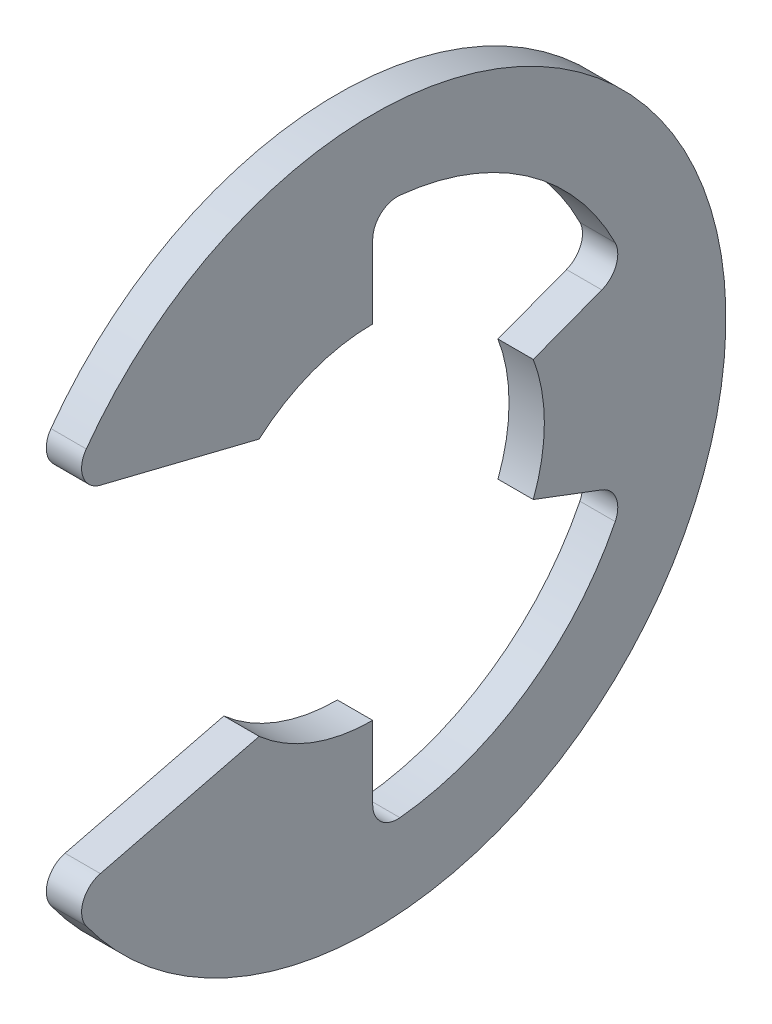
ISO-10303-21;
HEADER;
FILE_DESCRIPTION(('STEP AP214'),'2;1');
FILE_NAME('part.step','',(''),(''),'','','');
FILE_SCHEMA(('AUTOMOTIVE_DESIGN { 1 0 10303 214 1 1 1 1 }'));
ENDSEC;
DATA;
#1=APPLICATION_CONTEXT('core data for automotive mechanical design processes');
#2=APPLICATION_PROTOCOL_DEFINITION('international standard','automotive_design',2000,#1);
#3=PRODUCT_CONTEXT('',#1,'mechanical');
#4=PRODUCT('Part','Part','',(#3));
#5=PRODUCT_RELATED_PRODUCT_CATEGORY('part','',(#4));
#6=PRODUCT_DEFINITION_FORMATION('','',#4);
#7=PRODUCT_DEFINITION_CONTEXT('part definition',#1,'design');
#8=PRODUCT_DEFINITION('design','',#6,#7);
#9=PRODUCT_DEFINITION_SHAPE('','',#8);
#10=(LENGTH_UNIT() NAMED_UNIT(*) SI_UNIT(.MILLI.,.METRE.));
#11=(NAMED_UNIT(*) PLANE_ANGLE_UNIT() SI_UNIT($,.RADIAN.));
#12=(NAMED_UNIT(*) SI_UNIT($,.STERADIAN.) SOLID_ANGLE_UNIT());
#13=UNCERTAINTY_MEASURE_WITH_UNIT(LENGTH_MEASURE(1.E-05),#10,'distance_accuracy_value','');
#14=(GEOMETRIC_REPRESENTATION_CONTEXT(3) GLOBAL_UNCERTAINTY_ASSIGNED_CONTEXT((#13)) GLOBAL_UNIT_ASSIGNED_CONTEXT((#10,
#11,#12)) REPRESENTATION_CONTEXT('',''));
#15=CARTESIAN_POINT('',(0.,0.,0.));
#16=DIRECTION('',(0.,0.,1.));
#17=DIRECTION('',(1.,0.,0.));
#18=AXIS2_PLACEMENT_3D('',#15,#16,#17);
#19=CARTESIAN_POINT('',(0.3175,0.,0.));
#20=DIRECTION('',(-1.,0.,0.));
#21=DIRECTION('',(0.,0.,1.));
#22=AXIS2_PLACEMENT_3D('',#19,#20,#21);
#23=CYLINDRICAL_SURFACE('',#22,6.35);
#24=CARTESIAN_POINT('',(0.3175,0.,0.));
#25=DIRECTION('',(1.,0.,0.));
#26=DIRECTION('',(0.,0.,-1.));
#27=AXIS2_PLACEMENT_3D('',#24,#25,#26);
#28=CIRCLE('',#27,6.35);
#29=CARTESIAN_POINT('',(0.3175,-3.7148992719595,5.14995372786929));
#30=VERTEX_POINT('',#29);
#31=CARTESIAN_POINT('',(0.3175,3.7148992719595,5.14995372786929));
#32=VERTEX_POINT('',#31);
#33=EDGE_CURVE('E170',#30,#32,#28,.T.);
#34=ORIENTED_EDGE('',*,*,#33,.F.);
#35=DIRECTION('',(-1.,0.,0.));
#36=VECTOR('',#35,1.);
#37=CARTESIAN_POINT('',(0.3175,-3.7148992719595,5.14995372786929));
#38=LINE('',#37,#36);
#39=CARTESIAN_POINT('',(-0.3175,-3.7148992719595,5.14995372786929));
#40=VERTEX_POINT('',#39);
#41=EDGE_CURVE('E264',#30,#40,#38,.T.);
#42=ORIENTED_EDGE('',*,*,#41,.T.);
#43=CARTESIAN_POINT('',(-0.3175,0.,0.));
#44=DIRECTION('',(1.,0.,0.));
#45=DIRECTION('',(0.,0.,-1.));
#46=AXIS2_PLACEMENT_3D('',#43,#44,#45);
#47=CIRCLE('',#46,6.35);
#48=CARTESIAN_POINT('',(-0.3175,3.7148992719595,5.14995372786929));
#49=VERTEX_POINT('',#48);
#50=EDGE_CURVE('E208',#40,#49,#47,.T.);
#51=ORIENTED_EDGE('',*,*,#50,.T.);
#52=DIRECTION('',(-1.,0.,0.));
#53=VECTOR('',#52,1.);
#54=CARTESIAN_POINT('',(0.3175,3.7148992719595,5.14995372786929));
#55=LINE('',#54,#53);
#56=EDGE_CURVE('E262',#49,#32,#55,.F.);
#57=ORIENTED_EDGE('',*,*,#56,.T.);
#58=EDGE_LOOP('',(#34,#42,#51,#57));
#59=FACE_BOUND('',#58,.T.);
#60=ADVANCED_FACE('F32',(#59),#23,.T.);
#61=CARTESIAN_POINT('',(0.3175,3.17332392884382,5.5002286536677));
#62=DIRECTION('',(0.,0.970536829925373,-0.240952820606873));
#63=DIRECTION('',(0.,0.240952820606873,0.970536829925373));
#64=AXIS2_PLACEMENT_3D('',#61,#62,#63);
#65=PLANE('',#64);
#66=DIRECTION('',(0.,-0.240952820606873,-0.970536829925373));
#67=VECTOR('',#66,1.);
#68=CARTESIAN_POINT('',(0.3175,3.17332392884382,5.5002286536677));
#69=LINE('',#68,#67);
#70=CARTESIAN_POINT('',(0.3175,3.02345270202051,4.89656049567819));
#71=VERTEX_POINT('',#70);
#72=CARTESIAN_POINT('',(0.3175,2.314575,2.04126328026911));
#73=VERTEX_POINT('',#72);
#74=EDGE_CURVE('E156',#71,#73,#69,.T.);
#75=ORIENTED_EDGE('',*,*,#74,.F.);
#76=DIRECTION('',(-1.,0.,0.));
#77=VECTOR('',#76,1.);
#78=CARTESIAN_POINT('',(0.3175,3.02345270202051,4.89656049567819));
#79=LINE('',#78,#77);
#80=CARTESIAN_POINT('',(-0.3175,3.02345270202051,4.89656049567819));
#81=VERTEX_POINT('',#80);
#82=EDGE_CURVE('E276',#71,#81,#79,.T.);
#83=ORIENTED_EDGE('',*,*,#82,.T.);
#84=DIRECTION('',(0.,-0.240952820606873,-0.970536829925373));
#85=VECTOR('',#84,1.);
#86=CARTESIAN_POINT('',(-0.3175,3.17332392884382,5.5002286536677));
#87=LINE('',#86,#85);
#88=CARTESIAN_POINT('',(-0.3175,2.314575,2.04126328026911));
#89=VERTEX_POINT('',#88);
#90=EDGE_CURVE('E176',#81,#89,#87,.T.);
#91=ORIENTED_EDGE('',*,*,#90,.T.);
#92=DIRECTION('',(-1.,0.,0.));
#93=VECTOR('',#92,1.);
#94=CARTESIAN_POINT('',(0.3175,2.314575,2.04126328026911));
#95=LINE('',#94,#93);
#96=EDGE_CURVE('E173',#73,#89,#95,.T.);
#97=ORIENTED_EDGE('',*,*,#96,.F.);
#98=EDGE_LOOP('',(#75,#83,#91,#97));
#99=FACE_BOUND('',#98,.T.);
#100=ADVANCED_FACE('F174',(#99),#65,.F.);
#101=CARTESIAN_POINT('',(0.3175,0.,0.));
#102=DIRECTION('',(-1.,0.,0.));
#103=DIRECTION('',(0.,0.,1.));
#104=AXIS2_PLACEMENT_3D('',#101,#102,#103);
#105=CYLINDRICAL_SURFACE('',#104,3.0861);
#106=CARTESIAN_POINT('',(-0.3175,0.,0.));
#107=DIRECTION('',(-1.,0.,0.));
#108=DIRECTION('',(0.,0.,1.));
#109=AXIS2_PLACEMENT_3D('',#106,#107,#108);
#110=CIRCLE('',#109,3.0861);
#111=CARTESIAN_POINT('',(-0.3175,3.0861,0.));
#112=VERTEX_POINT('',#111);
#113=EDGE_CURVE('E212',#89,#112,#110,.T.);
#114=ORIENTED_EDGE('',*,*,#113,.T.);
#115=DIRECTION('',(-1.,0.,0.));
#116=VECTOR('',#115,1.);
#117=CARTESIAN_POINT('',(0.3175,3.0861,0.));
#118=LINE('',#117,#116);
#119=CARTESIAN_POINT('',(0.3175,3.0861,0.));
#120=VERTEX_POINT('',#119);
#121=EDGE_CURVE('E180',#120,#112,#118,.T.);
#122=ORIENTED_EDGE('',*,*,#121,.F.);
#123=CARTESIAN_POINT('',(0.3175,0.,0.));
#124=DIRECTION('',(-1.,0.,0.));
#125=DIRECTION('',(0.,0.,1.));
#126=AXIS2_PLACEMENT_3D('',#123,#124,#125);
#127=CIRCLE('',#126,3.0861);
#128=EDGE_CURVE('E162',#73,#120,#127,.T.);
#129=ORIENTED_EDGE('',*,*,#128,.F.);
#130=ORIENTED_EDGE('',*,*,#96,.T.);
#131=EDGE_LOOP('',(#114,#122,#129,#130));
#132=FACE_BOUND('',#131,.T.);
#133=ADVANCED_FACE('F182',(#132),#105,.F.);
#134=CARTESIAN_POINT('',(0.3175,3.0861,0.));
#135=DIRECTION('',(0.,0.,1.));
#136=DIRECTION('',(0.,-1.,0.));
#137=AXIS2_PLACEMENT_3D('',#134,#135,#136);
#138=PLANE('',#137);
#139=DIRECTION('',(0.,1.,0.));
#140=VECTOR('',#139,1.);
#141=CARTESIAN_POINT('',(-0.3175,3.0861,0.));
#142=LINE('',#141,#140);
#143=CARTESIAN_POINT('',(-0.3175,4.40336689167331,0.));
#144=VERTEX_POINT('',#143);
#145=EDGE_CURVE('E214',#112,#144,#142,.T.);
#146=ORIENTED_EDGE('',*,*,#145,.T.);
#147=DIRECTION('',(1.,0.,0.));
#148=VECTOR('',#147,1.);
#149=CARTESIAN_POINT('',(0.3175,4.40336689167331,0.));
#150=LINE('',#149,#148);
#151=CARTESIAN_POINT('',(0.3175,4.40336689167331,0.));
#152=VERTEX_POINT('',#151);
#153=EDGE_CURVE('E260',#144,#152,#150,.T.);
#154=ORIENTED_EDGE('',*,*,#153,.T.);
#155=DIRECTION('',(0.,1.,0.));
#156=VECTOR('',#155,1.);
#157=CARTESIAN_POINT('',(0.3175,3.0861,0.));
#158=LINE('',#157,#156);
#159=EDGE_CURVE('E185',#120,#152,#158,.T.);
#160=ORIENTED_EDGE('',*,*,#159,.F.);
#161=ORIENTED_EDGE('',*,*,#121,.T.);
#162=EDGE_LOOP('',(#146,#154,#160,#161));
#163=FACE_BOUND('',#162,.T.);
#164=ADVANCED_FACE('F382',(#163),#138,.F.);
#165=CARTESIAN_POINT('',(0.3175,0.,0.));
#166=DIRECTION('',(-1.,0.,0.));
#167=DIRECTION('',(0.,0.,1.));
#168=AXIS2_PLACEMENT_3D('',#165,#166,#167);
#169=CYLINDRICAL_SURFACE('',#168,4.87024516129032);
#170=CARTESIAN_POINT('',(0.3175,0.,0.));
#171=DIRECTION('',(-1.,0.,0.));
#172=DIRECTION('',(0.,0.,-1.));
#173=AXIS2_PLACEMENT_3D('',#170,#171,#172);
#174=CIRCLE('',#173,4.87024516129032);
#175=CARTESIAN_POINT('',(0.3175,4.84561932872465,-0.489143386096454));
#176=VERTEX_POINT('',#175);
#177=CARTESIAN_POINT('',(0.3175,2.17073688413976,-4.35972353606361));
#178=VERTEX_POINT('',#177);
#179=EDGE_CURVE('E187',#176,#178,#174,.T.);
#180=ORIENTED_EDGE('',*,*,#179,.F.);
#181=DIRECTION('',(-1.,0.,0.));
#182=VECTOR('',#181,1.);
#183=CARTESIAN_POINT('',(0.3175,4.84561932872465,-0.489143386096454));
#184=LINE('',#183,#182);
#185=CARTESIAN_POINT('',(-0.3175,4.84561932872465,-0.489143386096454));
#186=VERTEX_POINT('',#185);
#187=EDGE_CURVE('E257',#176,#186,#184,.T.);
#188=ORIENTED_EDGE('',*,*,#187,.T.);
#189=CARTESIAN_POINT('',(-0.3175,0.,0.));
#190=DIRECTION('',(-1.,0.,0.));
#191=DIRECTION('',(0.,0.,-1.));
#192=AXIS2_PLACEMENT_3D('',#189,#190,#191);
#193=CIRCLE('',#192,4.87024516129032);
#194=CARTESIAN_POINT('',(-0.3175,2.17073688413976,-4.35972353606361));
#195=VERTEX_POINT('',#194);
#196=EDGE_CURVE('E217',#186,#195,#193,.T.);
#197=ORIENTED_EDGE('',*,*,#196,.T.);
#198=DIRECTION('',(-1.,0.,0.));
#199=VECTOR('',#198,1.);
#200=CARTESIAN_POINT('',(0.3175,2.17073688413976,-4.35972353606361));
#201=LINE('',#200,#199);
#202=EDGE_CURVE('E255',#195,#178,#201,.F.);
#203=ORIENTED_EDGE('',*,*,#202,.T.);
#204=EDGE_LOOP('',(#180,#188,#197,#203));
#205=FACE_BOUND('',#204,.T.);
#206=ADVANCED_FACE('F304',(#205),#169,.F.);
#207=CARTESIAN_POINT('',(0.3175,1.0911011187099,-2.88678221533076));
#208=DIRECTION('',(0.,-0.935414346693485,-0.353553390593274));
#209=DIRECTION('',(0.,0.353553390593274,-0.935414346693485));
#210=AXIS2_PLACEMENT_3D('',#207,#208,#209);
#211=PLANE('',#210);
#212=DIRECTION('',(0.,-0.353553390593274,0.935414346693485));
#213=VECTOR('',#212,1.);
#214=CARTESIAN_POINT('',(0.3175,1.0911011187099,-2.88678221533076));
#215=LINE('',#214,#213);
#216=CARTESIAN_POINT('',(0.3175,1.55682529457727,-4.11897256422632));
#217=VERTEX_POINT('',#216);
#218=CARTESIAN_POINT('',(0.3175,1.0911011187099,-2.88678221533077));
#219=VERTEX_POINT('',#218);
#220=EDGE_CURVE('E192',#217,#219,#215,.T.);
#221=ORIENTED_EDGE('',*,*,#220,.F.);
#222=DIRECTION('',(1.,0.,0.));
#223=VECTOR('',#222,1.);
#224=CARTESIAN_POINT('',(-0.3175,1.55682529457727,-4.11897256422632));
#225=LINE('',#224,#223);
#226=CARTESIAN_POINT('',(-0.3175,1.55682529457727,-4.11897256422632));
#227=VERTEX_POINT('',#226);
#228=EDGE_CURVE('E279',#217,#227,#225,.F.);
#229=ORIENTED_EDGE('',*,*,#228,.T.);
#230=DIRECTION('',(0.,-0.353553390593274,0.935414346693485));
#231=VECTOR('',#230,1.);
#232=CARTESIAN_POINT('',(-0.3175,1.0911011187099,-2.88678221533076));
#233=LINE('',#232,#231);
#234=CARTESIAN_POINT('',(-0.3175,1.0911011187099,-2.88678221533077));
#235=VERTEX_POINT('',#234);
#236=EDGE_CURVE('E220',#227,#235,#233,.T.);
#237=ORIENTED_EDGE('',*,*,#236,.T.);
#238=DIRECTION('',(-1.,0.,0.));
#239=VECTOR('',#238,1.);
#240=CARTESIAN_POINT('',(0.3175,1.0911011187099,-2.88678221533077));
#241=LINE('',#240,#239);
#242=EDGE_CURVE('E244',#219,#235,#241,.T.);
#243=ORIENTED_EDGE('',*,*,#242,.F.);
#244=EDGE_LOOP('',(#221,#229,#237,#243));
#245=FACE_BOUND('',#244,.T.);
#246=ADVANCED_FACE('F307',(#245),#211,.F.);
#247=CARTESIAN_POINT('',(0.3175,0.,0.));
#248=DIRECTION('',(-1.,0.,0.));
#249=DIRECTION('',(0.,0.,1.));
#250=AXIS2_PLACEMENT_3D('',#247,#248,#249);
#251=CYLINDRICAL_SURFACE('',#250,3.0861);
#252=CARTESIAN_POINT('',(-0.3175,0.,0.));
#253=DIRECTION('',(-1.,0.,0.));
#254=DIRECTION('',(0.,0.,1.));
#255=AXIS2_PLACEMENT_3D('',#252,#253,#254);
#256=CIRCLE('',#255,3.0861);
#257=CARTESIAN_POINT('',(-0.3175,-1.0911011187099,-2.88678221533077));
#258=VERTEX_POINT('',#257);
#259=EDGE_CURVE('E222',#235,#258,#256,.T.);
#260=ORIENTED_EDGE('',*,*,#259,.T.);
#261=DIRECTION('',(-1.,0.,0.));
#262=VECTOR('',#261,1.);
#263=CARTESIAN_POINT('',(0.3175,-1.0911011187099,-2.88678221533077));
#264=LINE('',#263,#262);
#265=CARTESIAN_POINT('',(0.3175,-1.0911011187099,-2.88678221533077));
#266=VERTEX_POINT('',#265);
#267=EDGE_CURVE('E241',#266,#258,#264,.T.);
#268=ORIENTED_EDGE('',*,*,#267,.F.);
#269=CARTESIAN_POINT('',(0.3175,0.,0.));
#270=DIRECTION('',(-1.,0.,0.));
#271=DIRECTION('',(0.,0.,1.));
#272=AXIS2_PLACEMENT_3D('',#269,#270,#271);
#273=CIRCLE('',#272,3.0861);
#274=EDGE_CURVE('E194',#219,#266,#273,.T.);
#275=ORIENTED_EDGE('',*,*,#274,.F.);
#276=ORIENTED_EDGE('',*,*,#242,.T.);
#277=EDGE_LOOP('',(#260,#268,#275,#276));
#278=FACE_BOUND('',#277,.T.);
#279=ADVANCED_FACE('F313',(#278),#251,.F.);
#280=CARTESIAN_POINT('',(0.3175,-1.0911011187099,-2.88678221533077));
#281=DIRECTION('',(0.,0.935414346693485,-0.353553390593274));
#282=DIRECTION('',(0.,0.353553390593274,0.935414346693485));
#283=AXIS2_PLACEMENT_3D('',#280,#281,#282);
#284=PLANE('',#283);
#285=DIRECTION('',(0.,-0.353553390593274,-0.935414346693485));
#286=VECTOR('',#285,1.);
#287=CARTESIAN_POINT('',(-0.3175,-1.0911011187099,-2.88678221533077));
#288=LINE('',#287,#286);
#289=CARTESIAN_POINT('',(-0.3175,-1.55682529457726,-4.11897256422632));
#290=VERTEX_POINT('',#289);
#291=EDGE_CURVE('E224',#258,#290,#288,.T.);
#292=ORIENTED_EDGE('',*,*,#291,.T.);
#293=DIRECTION('',(1.,0.,0.));
#294=VECTOR('',#293,1.);
#295=CARTESIAN_POINT('',(0.3175,-1.55682529457726,-4.11897256422632));
#296=LINE('',#295,#294);
#297=CARTESIAN_POINT('',(0.3175,-1.55682529457726,-4.11897256422632));
#298=VERTEX_POINT('',#297);
#299=EDGE_CURVE('E47',#290,#298,#296,.T.);
#300=ORIENTED_EDGE('',*,*,#299,.T.);
#301=DIRECTION('',(0.,-0.353553390593274,-0.935414346693485));
#302=VECTOR('',#301,1.);
#303=CARTESIAN_POINT('',(0.3175,-1.0911011187099,-2.88678221533077));
#304=LINE('',#303,#302);
#305=EDGE_CURVE('E196',#266,#298,#304,.T.);
#306=ORIENTED_EDGE('',*,*,#305,.F.);
#307=ORIENTED_EDGE('',*,*,#267,.T.);
#308=EDGE_LOOP('',(#292,#300,#306,#307));
#309=FACE_BOUND('',#308,.T.);
#310=ADVANCED_FACE('F315',(#309),#284,.F.);
#311=CARTESIAN_POINT('',(0.3175,0.,0.));
#312=DIRECTION('',(-1.,0.,0.));
#313=DIRECTION('',(0.,0.,1.));
#314=AXIS2_PLACEMENT_3D('',#311,#312,#313);
#315=CYLINDRICAL_SURFACE('',#314,4.87024516129032);
#316=CARTESIAN_POINT('',(-0.3175,0.,0.));
#317=DIRECTION('',(-1.,0.,0.));
#318=DIRECTION('',(0.,0.,-1.));
#319=AXIS2_PLACEMENT_3D('',#316,#317,#318);
#320=CIRCLE('',#319,4.87024516129032);
#321=CARTESIAN_POINT('',(-0.3175,-2.17073688413975,-4.35972353606361));
#322=VERTEX_POINT('',#321);
#323=CARTESIAN_POINT('',(-0.3175,-4.84561932872465,-0.489143386096455));
#324=VERTEX_POINT('',#323);
#325=EDGE_CURVE('E226',#322,#324,#320,.T.);
#326=ORIENTED_EDGE('',*,*,#325,.T.);
#327=DIRECTION('',(-1.,0.,0.));
#328=VECTOR('',#327,1.);
#329=CARTESIAN_POINT('',(0.3175,-4.84561932872465,-0.489143386096455));
#330=LINE('',#329,#328);
#331=CARTESIAN_POINT('',(0.3175,-4.84561932872465,-0.489143386096455));
#332=VERTEX_POINT('',#331);
#333=EDGE_CURVE('E253',#324,#332,#330,.F.);
#334=ORIENTED_EDGE('',*,*,#333,.T.);
#335=CARTESIAN_POINT('',(0.3175,0.,0.));
#336=DIRECTION('',(-1.,0.,0.));
#337=DIRECTION('',(0.,0.,-1.));
#338=AXIS2_PLACEMENT_3D('',#335,#336,#337);
#339=CIRCLE('',#338,4.87024516129032);
#340=CARTESIAN_POINT('',(0.3175,-2.17073688413975,-4.35972353606361));
#341=VERTEX_POINT('',#340);
#342=EDGE_CURVE('E198',#341,#332,#339,.T.);
#343=ORIENTED_EDGE('',*,*,#342,.F.);
#344=DIRECTION('',(-1.,0.,0.));
#345=VECTOR('',#344,1.);
#346=CARTESIAN_POINT('',(0.3175,-2.17073688413975,-4.35972353606361));
#347=LINE('',#346,#345);
#348=EDGE_CURVE('E250',#341,#322,#347,.T.);
#349=ORIENTED_EDGE('',*,*,#348,.T.);
#350=EDGE_LOOP('',(#326,#334,#343,#349));
#351=FACE_BOUND('',#350,.T.);
#352=ADVANCED_FACE('F317',(#351),#315,.F.);
#353=CARTESIAN_POINT('',(0.3175,-3.0861,0.));
#354=DIRECTION('',(0.,0.,1.));
#355=DIRECTION('',(0.,-1.,0.));
#356=AXIS2_PLACEMENT_3D('',#353,#354,#355);
#357=PLANE('',#356);
#358=DIRECTION('',(0.,1.,0.));
#359=VECTOR('',#358,1.);
#360=CARTESIAN_POINT('',(0.3175,-3.0861,0.));
#361=LINE('',#360,#359);
#362=CARTESIAN_POINT('',(0.3175,-4.40336689167331,0.));
#363=VERTEX_POINT('',#362);
#364=CARTESIAN_POINT('',(0.3175,-3.0861,0.));
#365=VERTEX_POINT('',#364);
#366=EDGE_CURVE('E201',#363,#365,#361,.T.);
#367=ORIENTED_EDGE('',*,*,#366,.F.);
#368=DIRECTION('',(1.,0.,0.));
#369=VECTOR('',#368,1.);
#370=CARTESIAN_POINT('',(-0.3175,-4.40336689167331,0.));
#371=LINE('',#370,#369);
#372=CARTESIAN_POINT('',(-0.3175,-4.40336689167331,0.));
#373=VERTEX_POINT('',#372);
#374=EDGE_CURVE('E179',#363,#373,#371,.F.);
#375=ORIENTED_EDGE('',*,*,#374,.T.);
#376=DIRECTION('',(0.,1.,0.));
#377=VECTOR('',#376,1.);
#378=CARTESIAN_POINT('',(-0.3175,-3.0861,0.));
#379=LINE('',#378,#377);
#380=CARTESIAN_POINT('',(-0.3175,-3.0861,0.));
#381=VERTEX_POINT('',#380);
#382=EDGE_CURVE('E229',#373,#381,#379,.T.);
#383=ORIENTED_EDGE('',*,*,#382,.T.);
#384=DIRECTION('',(-1.,0.,0.));
#385=VECTOR('',#384,1.);
#386=CARTESIAN_POINT('',(0.3175,-3.0861,0.));
#387=LINE('',#386,#385);
#388=EDGE_CURVE('E238',#365,#381,#387,.T.);
#389=ORIENTED_EDGE('',*,*,#388,.F.);
#390=EDGE_LOOP('',(#367,#375,#383,#389));
#391=FACE_BOUND('',#390,.T.);
#392=ADVANCED_FACE('F323',(#391),#357,.F.);
#393=CARTESIAN_POINT('',(0.3175,0.,0.));
#394=DIRECTION('',(-1.,0.,0.));
#395=DIRECTION('',(0.,0.,1.));
#396=AXIS2_PLACEMENT_3D('',#393,#394,#395);
#397=CYLINDRICAL_SURFACE('',#396,3.0861);
#398=CARTESIAN_POINT('',(-0.3175,0.,0.));
#399=DIRECTION('',(-1.,0.,0.));
#400=DIRECTION('',(0.,0.,-1.));
#401=AXIS2_PLACEMENT_3D('',#398,#399,#400);
#402=CIRCLE('',#401,3.0861);
#403=CARTESIAN_POINT('',(-0.3175,-2.314575,2.04126328026911));
#404=VERTEX_POINT('',#403);
#405=EDGE_CURVE('E231',#381,#404,#402,.T.);
#406=ORIENTED_EDGE('',*,*,#405,.T.);
#407=DIRECTION('',(-1.,0.,0.));
#408=VECTOR('',#407,1.);
#409=CARTESIAN_POINT('',(0.3175,-2.314575,2.04126328026911));
#410=LINE('',#409,#408);
#411=CARTESIAN_POINT('',(0.3175,-2.314575,2.04126328026911));
#412=VERTEX_POINT('',#411);
#413=EDGE_CURVE('E207',#412,#404,#410,.T.);
#414=ORIENTED_EDGE('',*,*,#413,.F.);
#415=CARTESIAN_POINT('',(0.3175,0.,0.));
#416=DIRECTION('',(-1.,0.,0.));
#417=DIRECTION('',(0.,0.,-1.));
#418=AXIS2_PLACEMENT_3D('',#415,#416,#417);
#419=CIRCLE('',#418,3.0861);
#420=EDGE_CURVE('E203',#365,#412,#419,.T.);
#421=ORIENTED_EDGE('',*,*,#420,.F.);
#422=ORIENTED_EDGE('',*,*,#388,.T.);
#423=EDGE_LOOP('',(#406,#414,#421,#422));
#424=FACE_BOUND('',#423,.T.);
#425=ADVANCED_FACE('F372',(#424),#397,.F.);
#426=CARTESIAN_POINT('',(0.3175,-3.17332392884383,5.5002286536677));
#427=DIRECTION('',(0.,-0.970536829925373,-0.240952820606873));
#428=DIRECTION('',(0.,0.240952820606873,-0.970536829925373));
#429=AXIS2_PLACEMENT_3D('',#426,#427,#428);
#430=PLANE('',#429);
#431=DIRECTION('',(0.,-0.240952820606873,0.970536829925373));
#432=VECTOR('',#431,1.);
#433=CARTESIAN_POINT('',(-0.3175,-3.17332392884383,5.5002286536677));
#434=LINE('',#433,#432);
#435=CARTESIAN_POINT('',(-0.3175,-3.02345270202051,4.89656049567819));
#436=VERTEX_POINT('',#435);
#437=EDGE_CURVE('E233',#404,#436,#434,.T.);
#438=ORIENTED_EDGE('',*,*,#437,.T.);
#439=DIRECTION('',(-1.,0.,0.));
#440=VECTOR('',#439,1.);
#441=CARTESIAN_POINT('',(0.3175,-3.02345270202051,4.89656049567819));
#442=LINE('',#441,#440);
#443=CARTESIAN_POINT('',(0.3175,-3.02345270202051,4.89656049567819));
#444=VERTEX_POINT('',#443);
#445=EDGE_CURVE('E271',#436,#444,#442,.F.);
#446=ORIENTED_EDGE('',*,*,#445,.T.);
#447=DIRECTION('',(0.,-0.240952820606873,0.970536829925373));
#448=VECTOR('',#447,1.);
#449=CARTESIAN_POINT('',(0.3175,-3.17332392884383,5.5002286536677));
#450=LINE('',#449,#448);
#451=EDGE_CURVE('E205',#412,#444,#450,.T.);
#452=ORIENTED_EDGE('',*,*,#451,.F.);
#453=ORIENTED_EDGE('',*,*,#413,.T.);
#454=EDGE_LOOP('',(#438,#446,#452,#453));
#455=FACE_BOUND('',#454,.T.);
#456=ADVANCED_FACE('F414',(#455),#430,.F.);
#457=CARTESIAN_POINT('',(0.3175,0.,0.));
#458=DIRECTION('',(1.,0.,0.));
#459=DIRECTION('',(0.,0.,-1.));
#460=AXIS2_PLACEMENT_3D('',#457,#458,#459);
#461=PLANE('',#460);
#462=ORIENTED_EDGE('',*,*,#451,.T.);
#463=CARTESIAN_POINT('',(0.3175,-3.45485632292234,4.78945696691844));
#464=DIRECTION('',(1.,0.,0.));
#465=DIRECTION('',(0.,0.,-1.));
#466=AXIS2_PLACEMENT_3D('',#463,#464,#465);
#467=CIRCLE('',#466,0.4445);
#468=EDGE_CURVE('E274',#444,#30,#467,.T.);
#469=ORIENTED_EDGE('',*,*,#468,.T.);
#470=ORIENTED_EDGE('',*,*,#33,.T.);
#471=CARTESIAN_POINT('',(0.3175,3.45485632292234,4.78945696691844));
#472=DIRECTION('',(1.,0.,0.));
#473=DIRECTION('',(0.,0.,-1.));
#474=AXIS2_PLACEMENT_3D('',#471,#472,#473);
#475=CIRCLE('',#474,0.4445);
#476=EDGE_CURVE('E166',#32,#71,#475,.T.);
#477=ORIENTED_EDGE('',*,*,#476,.T.);
#478=ORIENTED_EDGE('',*,*,#74,.T.);
#479=ORIENTED_EDGE('',*,*,#128,.T.);
#480=ORIENTED_EDGE('',*,*,#159,.T.);
#481=CARTESIAN_POINT('',(0.3175,4.40336689167331,-0.444499999999999));
#482=DIRECTION('',(1.,0.,0.));
#483=DIRECTION('',(0.,0.,-1.));
#484=AXIS2_PLACEMENT_3D('',#481,#482,#483);
#485=CIRCLE('',#484,0.4445);
#486=EDGE_CURVE('E288',#152,#176,#485,.F.);
#487=ORIENTED_EDGE('',*,*,#486,.T.);
#488=ORIENTED_EDGE('',*,*,#179,.T.);
#489=CARTESIAN_POINT('',(0.3175,1.97261697168252,-3.96181808210761));
#490=DIRECTION('',(1.,0.,0.));
#491=DIRECTION('',(0.,0.,-1.));
#492=AXIS2_PLACEMENT_3D('',#489,#490,#491);
#493=CIRCLE('',#492,0.4445);
#494=EDGE_CURVE('E11',#178,#217,#493,.F.);
#495=ORIENTED_EDGE('',*,*,#494,.T.);
#496=ORIENTED_EDGE('',*,*,#220,.T.);
#497=ORIENTED_EDGE('',*,*,#274,.T.);
#498=ORIENTED_EDGE('',*,*,#305,.T.);
#499=CARTESIAN_POINT('',(0.3175,-1.97261697168252,-3.96181808210761));
#500=DIRECTION('',(1.,0.,0.));
#501=DIRECTION('',(0.,0.,-1.));
#502=AXIS2_PLACEMENT_3D('',#499,#500,#501);
#503=CIRCLE('',#502,0.4445);
#504=EDGE_CURVE('E292',#298,#341,#503,.F.);
#505=ORIENTED_EDGE('',*,*,#504,.T.);
#506=ORIENTED_EDGE('',*,*,#342,.T.);
#507=CARTESIAN_POINT('',(0.3175,-4.40336689167331,-0.4445));
#508=DIRECTION('',(1.,0.,0.));
#509=DIRECTION('',(0.,0.,-1.));
#510=AXIS2_PLACEMENT_3D('',#507,#508,#509);
#511=CIRCLE('',#510,0.4445);
#512=EDGE_CURVE('E284',#332,#363,#511,.F.);
#513=ORIENTED_EDGE('',*,*,#512,.T.);
#514=ORIENTED_EDGE('',*,*,#366,.T.);
#515=ORIENTED_EDGE('',*,*,#420,.T.);
#516=EDGE_LOOP('',(#462,#469,#470,#477,#478,#479,#480,#487,#488,#495,#496,#497,#498,#505,#506,
#513,#514,#515));
#517=FACE_BOUND('',#516,.T.);
#518=ADVANCED_FACE('F159',(#517),#461,.T.);
#519=CARTESIAN_POINT('',(-0.3175,0.,0.));
#520=DIRECTION('',(1.,0.,0.));
#521=DIRECTION('',(0.,0.,-1.));
#522=AXIS2_PLACEMENT_3D('',#519,#520,#521);
#523=PLANE('',#522);
#524=ORIENTED_EDGE('',*,*,#50,.F.);
#525=CARTESIAN_POINT('',(-0.3175,-3.45485632292234,4.78945696691844));
#526=DIRECTION('',(1.,0.,0.));
#527=DIRECTION('',(0.,0.,-1.));
#528=AXIS2_PLACEMENT_3D('',#525,#526,#527);
#529=CIRCLE('',#528,0.4445);
#530=EDGE_CURVE('E269',#40,#436,#529,.F.);
#531=ORIENTED_EDGE('',*,*,#530,.T.);
#532=ORIENTED_EDGE('',*,*,#437,.F.);
#533=ORIENTED_EDGE('',*,*,#405,.F.);
#534=ORIENTED_EDGE('',*,*,#382,.F.);
#535=CARTESIAN_POINT('',(-0.3175,-4.40336689167331,-0.4445));
#536=DIRECTION('',(1.,0.,0.));
#537=DIRECTION('',(0.,0.,-1.));
#538=AXIS2_PLACEMENT_3D('',#535,#536,#537);
#539=CIRCLE('',#538,0.4445);
#540=EDGE_CURVE('E282',#373,#324,#539,.T.);
#541=ORIENTED_EDGE('',*,*,#540,.T.);
#542=ORIENTED_EDGE('',*,*,#325,.F.);
#543=CARTESIAN_POINT('',(-0.3175,-1.97261697168252,-3.96181808210761));
#544=DIRECTION('',(1.,0.,0.));
#545=DIRECTION('',(0.,0.,-1.));
#546=AXIS2_PLACEMENT_3D('',#543,#544,#545);
#547=CIRCLE('',#546,0.4445);
#548=EDGE_CURVE('E290',#322,#290,#547,.T.);
#549=ORIENTED_EDGE('',*,*,#548,.T.);
#550=ORIENTED_EDGE('',*,*,#291,.F.);
#551=ORIENTED_EDGE('',*,*,#259,.F.);
#552=ORIENTED_EDGE('',*,*,#236,.F.);
#553=CARTESIAN_POINT('',(-0.3175,1.97261697168252,-3.96181808210761));
#554=DIRECTION('',(1.,0.,0.));
#555=DIRECTION('',(0.,0.,-1.));
#556=AXIS2_PLACEMENT_3D('',#553,#554,#555);
#557=CIRCLE('',#556,0.4445);
#558=EDGE_CURVE('E40',#227,#195,#557,.T.);
#559=ORIENTED_EDGE('',*,*,#558,.T.);
#560=ORIENTED_EDGE('',*,*,#196,.F.);
#561=CARTESIAN_POINT('',(-0.3175,4.40336689167331,-0.444499999999999));
#562=DIRECTION('',(1.,0.,0.));
#563=DIRECTION('',(0.,0.,-1.));
#564=AXIS2_PLACEMENT_3D('',#561,#562,#563);
#565=CIRCLE('',#564,0.4445);
#566=EDGE_CURVE('E286',#186,#144,#565,.T.);
#567=ORIENTED_EDGE('',*,*,#566,.T.);
#568=ORIENTED_EDGE('',*,*,#145,.F.);
#569=ORIENTED_EDGE('',*,*,#113,.F.);
#570=ORIENTED_EDGE('',*,*,#90,.F.);
#571=CARTESIAN_POINT('',(-0.3175,3.45485632292234,4.78945696691844));
#572=DIRECTION('',(1.,0.,0.));
#573=DIRECTION('',(0.,0.,-1.));
#574=AXIS2_PLACEMENT_3D('',#571,#572,#573);
#575=CIRCLE('',#574,0.4445);
#576=EDGE_CURVE('E267',#81,#49,#575,.F.);
#577=ORIENTED_EDGE('',*,*,#576,.T.);
#578=EDGE_LOOP('',(#524,#531,#532,#533,#534,#541,#542,#549,#550,#551,#552,#559,#560,#567,#568,
#569,#570,#577));
#579=FACE_BOUND('',#578,.T.);
#580=ADVANCED_FACE('F297',(#579),#523,.F.);
#581=CARTESIAN_POINT('',(0.3175,-4.40336689167331,-0.4445));
#582=DIRECTION('',(-1.,0.,0.));
#583=DIRECTION('',(0.,0.,1.));
#584=AXIS2_PLACEMENT_3D('',#581,#582,#583);
#585=CYLINDRICAL_SURFACE('',#584,0.4445);
#586=ORIENTED_EDGE('',*,*,#512,.F.);
#587=ORIENTED_EDGE('',*,*,#333,.F.);
#588=ORIENTED_EDGE('',*,*,#540,.F.);
#589=ORIENTED_EDGE('',*,*,#374,.F.);
#590=EDGE_LOOP('',(#586,#587,#588,#589));
#591=FACE_BOUND('',#590,.T.);
#592=ADVANCED_FACE('F337',(#591),#585,.F.);
#593=CARTESIAN_POINT('',(0.3175,4.40336689167331,-0.444499999999999));
#594=DIRECTION('',(-1.,0.,0.));
#595=DIRECTION('',(0.,0.,1.));
#596=AXIS2_PLACEMENT_3D('',#593,#594,#595);
#597=CYLINDRICAL_SURFACE('',#596,0.4445);
#598=ORIENTED_EDGE('',*,*,#486,.F.);
#599=ORIENTED_EDGE('',*,*,#153,.F.);
#600=ORIENTED_EDGE('',*,*,#566,.F.);
#601=ORIENTED_EDGE('',*,*,#187,.F.);
#602=EDGE_LOOP('',(#598,#599,#600,#601));
#603=FACE_BOUND('',#602,.T.);
#604=ADVANCED_FACE('F340',(#603),#597,.F.);
#605=CARTESIAN_POINT('',(0.3175,-3.45485632292234,4.78945696691844));
#606=DIRECTION('',(-1.,0.,0.));
#607=DIRECTION('',(0.,0.,1.));
#608=AXIS2_PLACEMENT_3D('',#605,#606,#607);
#609=CYLINDRICAL_SURFACE('',#608,0.4445);
#610=ORIENTED_EDGE('',*,*,#468,.F.);
#611=ORIENTED_EDGE('',*,*,#445,.F.);
#612=ORIENTED_EDGE('',*,*,#530,.F.);
#613=ORIENTED_EDGE('',*,*,#41,.F.);
#614=EDGE_LOOP('',(#610,#611,#612,#613));
#615=FACE_BOUND('',#614,.T.);
#616=ADVANCED_FACE('F344',(#615),#609,.T.);
#617=CARTESIAN_POINT('',(0.3175,3.45485632292234,4.78945696691844));
#618=DIRECTION('',(-1.,0.,0.));
#619=DIRECTION('',(0.,0.,1.));
#620=AXIS2_PLACEMENT_3D('',#617,#618,#619);
#621=CYLINDRICAL_SURFACE('',#620,0.4445);
#622=ORIENTED_EDGE('',*,*,#476,.F.);
#623=ORIENTED_EDGE('',*,*,#56,.F.);
#624=ORIENTED_EDGE('',*,*,#576,.F.);
#625=ORIENTED_EDGE('',*,*,#82,.F.);
#626=EDGE_LOOP('',(#622,#623,#624,#625));
#627=FACE_BOUND('',#626,.T.);
#628=ADVANCED_FACE('F348',(#627),#621,.T.);
#629=CARTESIAN_POINT('',(0.3175,-1.97261697168252,-3.96181808210761));
#630=DIRECTION('',(-1.,0.,0.));
#631=DIRECTION('',(0.,0.,1.));
#632=AXIS2_PLACEMENT_3D('',#629,#630,#631);
#633=CYLINDRICAL_SURFACE('',#632,0.4445);
#634=ORIENTED_EDGE('',*,*,#504,.F.);
#635=ORIENTED_EDGE('',*,*,#299,.F.);
#636=ORIENTED_EDGE('',*,*,#548,.F.);
#637=ORIENTED_EDGE('',*,*,#348,.F.);
#638=EDGE_LOOP('',(#634,#635,#636,#637));
#639=FACE_BOUND('',#638,.T.);
#640=ADVANCED_FACE('F351',(#639),#633,.F.);
#641=CARTESIAN_POINT('',(0.3175,1.97261697168252,-3.96181808210761));
#642=DIRECTION('',(-1.,0.,0.));
#643=DIRECTION('',(0.,0.,1.));
#644=AXIS2_PLACEMENT_3D('',#641,#642,#643);
#645=CYLINDRICAL_SURFACE('',#644,0.4445);
#646=ORIENTED_EDGE('',*,*,#494,.F.);
#647=ORIENTED_EDGE('',*,*,#202,.F.);
#648=ORIENTED_EDGE('',*,*,#558,.F.);
#649=ORIENTED_EDGE('',*,*,#228,.F.);
#650=EDGE_LOOP('',(#646,#647,#648,#649));
#651=FACE_BOUND('',#650,.T.);
#652=ADVANCED_FACE('F34',(#651),#645,.F.);
#653=CLOSED_SHELL('',(#60,#100,#133,#164,#206,#246,#279,#310,#352,#392,#425,#456,#518,#580,#592,
#604,#616,#628,#640,#652));
#654=MANIFOLD_SOLID_BREP('B2',#653);
#655=ADVANCED_BREP_SHAPE_REPRESENTATION('',(#18,#654),#14);
#656=SHAPE_DEFINITION_REPRESENTATION(#9,#655);
ENDSEC;
END-ISO-10303-21;
